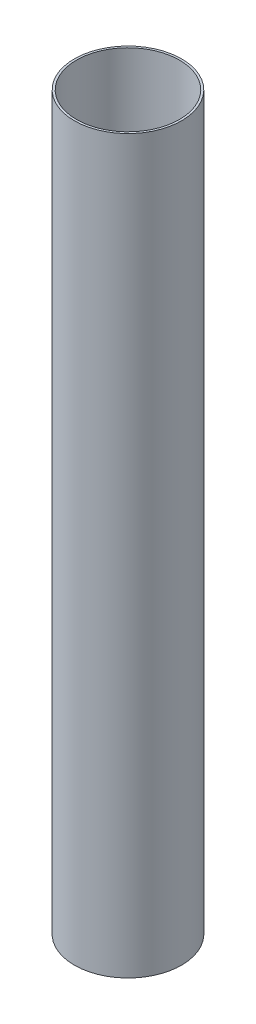
ISO-10303-21;
HEADER;
FILE_DESCRIPTION(('STEP AP214'),'2;1');
FILE_NAME('part.step','',(''),(''),'','','');
FILE_SCHEMA(('AUTOMOTIVE_DESIGN { 1 0 10303 214 1 1 1 1 }'));
ENDSEC;
DATA;
#1=APPLICATION_CONTEXT('core data for automotive mechanical design processes');
#2=APPLICATION_PROTOCOL_DEFINITION('international standard','automotive_design',2000,#1);
#3=PRODUCT_CONTEXT('',#1,'mechanical');
#4=PRODUCT('Part','Part','',(#3));
#5=PRODUCT_RELATED_PRODUCT_CATEGORY('part','',(#4));
#6=PRODUCT_DEFINITION_FORMATION('','',#4);
#7=PRODUCT_DEFINITION_CONTEXT('part definition',#1,'design');
#8=PRODUCT_DEFINITION('design','',#6,#7);
#9=PRODUCT_DEFINITION_SHAPE('','',#8);
#10=(LENGTH_UNIT() NAMED_UNIT(*) SI_UNIT(.MILLI.,.METRE.));
#11=(NAMED_UNIT(*) PLANE_ANGLE_UNIT() SI_UNIT($,.RADIAN.));
#12=(NAMED_UNIT(*) SI_UNIT($,.STERADIAN.) SOLID_ANGLE_UNIT());
#13=UNCERTAINTY_MEASURE_WITH_UNIT(LENGTH_MEASURE(1.E-05),#10,'distance_accuracy_value','');
#14=(GEOMETRIC_REPRESENTATION_CONTEXT(3) GLOBAL_UNCERTAINTY_ASSIGNED_CONTEXT((#13)) GLOBAL_UNIT_ASSIGNED_CONTEXT((#10,
#11,#12)) REPRESENTATION_CONTEXT('',''));
#15=CARTESIAN_POINT('',(0.,0.,0.));
#16=DIRECTION('',(0.,0.,1.));
#17=DIRECTION('',(1.,0.,0.));
#18=AXIS2_PLACEMENT_3D('',#15,#16,#17);
#19=CARTESIAN_POINT('',(0.,270.51,0.));
#20=DIRECTION('',(0.,1.,0.));
#21=DIRECTION('',(0.,0.,1.));
#22=AXIS2_PLACEMENT_3D('',#19,#20,#21);
#23=PLANE('',#22);
#24=CARTESIAN_POINT('',(0.,270.51,0.));
#25=DIRECTION('',(0.,1.,0.));
#26=DIRECTION('',(0.,0.,1.));
#27=AXIS2_PLACEMENT_3D('',#24,#25,#26);
#28=CIRCLE('',#27,39.6748);
#29=CARTESIAN_POINT('',(0.,270.51,39.6748));
#30=VERTEX_POINT('',#29);
#31=EDGE_CURVE('E10',#30,#30,#28,.T.);
#32=ORIENTED_EDGE('',*,*,#31,.T.);
#33=EDGE_LOOP('',(#32));
#34=FACE_BOUND('',#33,.T.);
#35=CARTESIAN_POINT('',(0.,270.51,0.));
#36=DIRECTION('',(0.,1.,0.));
#37=DIRECTION('',(0.,0.,1.));
#38=AXIS2_PLACEMENT_3D('',#35,#36,#37);
#39=CIRCLE('',#38,38.1);
#40=CARTESIAN_POINT('',(0.,270.51,38.1));
#41=VERTEX_POINT('',#40);
#42=EDGE_CURVE('E48',#41,#41,#39,.T.);
#43=ORIENTED_EDGE('',*,*,#42,.F.);
#44=EDGE_LOOP('',(#43));
#45=FACE_BOUND('',#44,.T.);
#46=ADVANCED_FACE('F37',(#34,#45),#23,.T.);
#47=CARTESIAN_POINT('',(0.,-270.51,0.));
#48=DIRECTION('',(0.,1.,0.));
#49=DIRECTION('',(0.,0.,1.));
#50=AXIS2_PLACEMENT_3D('',#47,#48,#49);
#51=PLANE('',#50);
#52=CARTESIAN_POINT('',(0.,-270.51,0.));
#53=DIRECTION('',(0.,1.,0.));
#54=DIRECTION('',(0.,0.,1.));
#55=AXIS2_PLACEMENT_3D('',#52,#53,#54);
#56=CIRCLE('',#55,39.6748);
#57=CARTESIAN_POINT('',(0.,-270.51,39.6748));
#58=VERTEX_POINT('',#57);
#59=EDGE_CURVE('E41',#58,#58,#56,.T.);
#60=ORIENTED_EDGE('',*,*,#59,.F.);
#61=EDGE_LOOP('',(#60));
#62=FACE_BOUND('',#61,.T.);
#63=CARTESIAN_POINT('',(0.,-270.51,0.));
#64=DIRECTION('',(0.,1.,0.));
#65=DIRECTION('',(0.,0.,1.));
#66=AXIS2_PLACEMENT_3D('',#63,#64,#65);
#67=CIRCLE('',#66,38.1);
#68=CARTESIAN_POINT('',(0.,-270.51,38.1));
#69=VERTEX_POINT('',#68);
#70=EDGE_CURVE('E50',#69,#69,#67,.T.);
#71=ORIENTED_EDGE('',*,*,#70,.T.);
#72=EDGE_LOOP('',(#71));
#73=FACE_BOUND('',#72,.T.);
#74=ADVANCED_FACE('F60',(#62,#73),#51,.F.);
#75=CARTESIAN_POINT('',(0.,270.51,0.));
#76=DIRECTION('',(0.,-1.,0.));
#77=DIRECTION('',(0.,0.,-1.));
#78=AXIS2_PLACEMENT_3D('',#75,#76,#77);
#79=CYLINDRICAL_SURFACE('',#78,39.6748);
#80=ORIENTED_EDGE('',*,*,#31,.F.);
#81=EDGE_LOOP('',(#80));
#82=FACE_BOUND('',#81,.T.);
#83=ORIENTED_EDGE('',*,*,#59,.T.);
#84=EDGE_LOOP('',(#83));
#85=FACE_BOUND('',#84,.T.);
#86=ADVANCED_FACE('F39',(#82,#85),#79,.T.);
#87=CARTESIAN_POINT('',(0.,270.51,0.));
#88=DIRECTION('',(0.,-1.,0.));
#89=DIRECTION('',(0.,0.,-1.));
#90=AXIS2_PLACEMENT_3D('',#87,#88,#89);
#91=CYLINDRICAL_SURFACE('',#90,38.1);
#92=ORIENTED_EDGE('',*,*,#42,.T.);
#93=EDGE_LOOP('',(#92));
#94=FACE_BOUND('',#93,.T.);
#95=ORIENTED_EDGE('',*,*,#70,.F.);
#96=EDGE_LOOP('',(#95));
#97=FACE_BOUND('',#96,.T.);
#98=ADVANCED_FACE('F56',(#94,#97),#91,.F.);
#99=CLOSED_SHELL('',(#46,#74,#86,#98));
#100=MANIFOLD_SOLID_BREP('B2',#99);
#101=ADVANCED_BREP_SHAPE_REPRESENTATION('',(#18,#100),#14);
#102=SHAPE_DEFINITION_REPRESENTATION(#9,#101);
ENDSEC;
END-ISO-10303-21;
